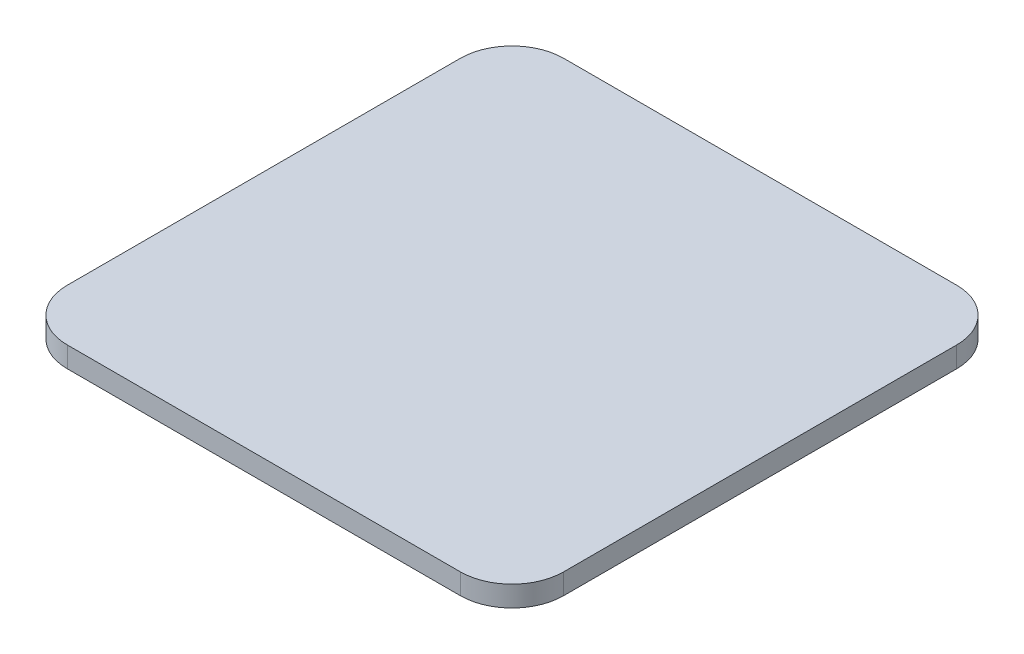
ISO-10303-21;
HEADER;
FILE_DESCRIPTION(('STEP AP214'),'2;1');
FILE_NAME('part.step','',(''),(''),'','','');
FILE_SCHEMA(('AUTOMOTIVE_DESIGN { 1 0 10303 214 1 1 1 1 }'));
ENDSEC;
DATA;
#1=APPLICATION_CONTEXT('core data for automotive mechanical design processes');
#2=APPLICATION_PROTOCOL_DEFINITION('international standard','automotive_design',2000,#1);
#3=PRODUCT_CONTEXT('',#1,'mechanical');
#4=PRODUCT('Part','Part','',(#3));
#5=PRODUCT_RELATED_PRODUCT_CATEGORY('part','',(#4));
#6=PRODUCT_DEFINITION_FORMATION('','',#4);
#7=PRODUCT_DEFINITION_CONTEXT('part definition',#1,'design');
#8=PRODUCT_DEFINITION('design','',#6,#7);
#9=PRODUCT_DEFINITION_SHAPE('','',#8);
#10=(LENGTH_UNIT() NAMED_UNIT(*) SI_UNIT(.MILLI.,.METRE.));
#11=(NAMED_UNIT(*) PLANE_ANGLE_UNIT() SI_UNIT($,.RADIAN.));
#12=(NAMED_UNIT(*) SI_UNIT($,.STERADIAN.) SOLID_ANGLE_UNIT());
#13=UNCERTAINTY_MEASURE_WITH_UNIT(LENGTH_MEASURE(1.E-05),#10,'distance_accuracy_value','');
#14=(GEOMETRIC_REPRESENTATION_CONTEXT(3) GLOBAL_UNCERTAINTY_ASSIGNED_CONTEXT((#13)) GLOBAL_UNIT_ASSIGNED_CONTEXT((#10,
#11,#12)) REPRESENTATION_CONTEXT('',''));
#15=CARTESIAN_POINT('',(0.,0.,0.));
#16=DIRECTION('',(0.,0.,1.));
#17=DIRECTION('',(1.,0.,0.));
#18=AXIS2_PLACEMENT_3D('',#15,#16,#17);
#19=CARTESIAN_POINT('',(19.,2.,19.));
#20=DIRECTION('',(0.,-1.,0.));
#21=DIRECTION('',(0.,0.,-1.));
#22=AXIS2_PLACEMENT_3D('',#19,#20,#21);
#23=CYLINDRICAL_SURFACE('',#22,5.);
#24=CARTESIAN_POINT('',(19.,0.,19.));
#25=DIRECTION('',(0.,1.,0.));
#26=DIRECTION('',(0.,0.,1.));
#27=AXIS2_PLACEMENT_3D('',#24,#25,#26);
#28=CIRCLE('',#27,5.);
#29=CARTESIAN_POINT('',(19.,0.,24.));
#30=VERTEX_POINT('',#29);
#31=CARTESIAN_POINT('',(24.,0.,19.));
#32=VERTEX_POINT('',#31);
#33=EDGE_CURVE('E140',#30,#32,#28,.T.);
#34=ORIENTED_EDGE('',*,*,#33,.T.);
#35=DIRECTION('',(0.,-1.,0.));
#36=VECTOR('',#35,1.);
#37=CARTESIAN_POINT('',(24.,2.,19.));
#38=LINE('',#37,#36);
#39=CARTESIAN_POINT('',(24.,2.,19.));
#40=VERTEX_POINT('',#39);
#41=EDGE_CURVE('E11',#40,#32,#38,.T.);
#42=ORIENTED_EDGE('',*,*,#41,.F.);
#43=CARTESIAN_POINT('',(19.,2.,19.));
#44=DIRECTION('',(0.,1.,0.));
#45=DIRECTION('',(0.,0.,1.));
#46=AXIS2_PLACEMENT_3D('',#43,#44,#45);
#47=CIRCLE('',#46,5.);
#48=CARTESIAN_POINT('',(19.,2.,24.));
#49=VERTEX_POINT('',#48);
#50=EDGE_CURVE('E162',#49,#40,#47,.T.);
#51=ORIENTED_EDGE('',*,*,#50,.F.);
#52=DIRECTION('',(0.,-1.,0.));
#53=VECTOR('',#52,1.);
#54=CARTESIAN_POINT('',(19.,2.,24.));
#55=LINE('',#54,#53);
#56=EDGE_CURVE('E136',#49,#30,#55,.T.);
#57=ORIENTED_EDGE('',*,*,#56,.T.);
#58=EDGE_LOOP('',(#34,#42,#51,#57));
#59=FACE_BOUND('',#58,.T.);
#60=ADVANCED_FACE('F39',(#59),#23,.T.);
#61=CARTESIAN_POINT('',(24.,2.,-19.));
#62=DIRECTION('',(-1.,0.,0.));
#63=DIRECTION('',(0.,0.,1.));
#64=AXIS2_PLACEMENT_3D('',#61,#62,#63);
#65=PLANE('',#64);
#66=DIRECTION('',(0.,0.,-1.));
#67=VECTOR('',#66,1.);
#68=CARTESIAN_POINT('',(24.,0.,-19.));
#69=LINE('',#68,#67);
#70=CARTESIAN_POINT('',(24.,0.,-19.));
#71=VERTEX_POINT('',#70);
#72=EDGE_CURVE('E144',#32,#71,#69,.T.);
#73=ORIENTED_EDGE('',*,*,#72,.T.);
#74=DIRECTION('',(0.,-1.,0.));
#75=VECTOR('',#74,1.);
#76=CARTESIAN_POINT('',(24.,2.,-19.));
#77=LINE('',#76,#75);
#78=CARTESIAN_POINT('',(24.,2.,-19.));
#79=VERTEX_POINT('',#78);
#80=EDGE_CURVE('E48',#79,#71,#77,.T.);
#81=ORIENTED_EDGE('',*,*,#80,.F.);
#82=DIRECTION('',(0.,0.,-1.));
#83=VECTOR('',#82,1.);
#84=CARTESIAN_POINT('',(24.,2.,-19.));
#85=LINE('',#84,#83);
#86=EDGE_CURVE('E99',#40,#79,#85,.T.);
#87=ORIENTED_EDGE('',*,*,#86,.F.);
#88=ORIENTED_EDGE('',*,*,#41,.T.);
#89=EDGE_LOOP('',(#73,#81,#87,#88));
#90=FACE_BOUND('',#89,.T.);
#91=ADVANCED_FACE('F208',(#90),#65,.F.);
#92=CARTESIAN_POINT('',(19.,2.,-19.));
#93=DIRECTION('',(0.,-1.,0.));
#94=DIRECTION('',(0.,0.,-1.));
#95=AXIS2_PLACEMENT_3D('',#92,#93,#94);
#96=CYLINDRICAL_SURFACE('',#95,5.);
#97=CARTESIAN_POINT('',(19.,0.,-19.));
#98=DIRECTION('',(0.,1.,0.));
#99=DIRECTION('',(0.,0.,1.));
#100=AXIS2_PLACEMENT_3D('',#97,#98,#99);
#101=CIRCLE('',#100,5.);
#102=CARTESIAN_POINT('',(19.,0.,-24.));
#103=VERTEX_POINT('',#102);
#104=EDGE_CURVE('E147',#71,#103,#101,.T.);
#105=ORIENTED_EDGE('',*,*,#104,.T.);
#106=DIRECTION('',(0.,-1.,0.));
#107=VECTOR('',#106,1.);
#108=CARTESIAN_POINT('',(19.,2.,-24.));
#109=LINE('',#108,#107);
#110=CARTESIAN_POINT('',(19.,2.,-24.));
#111=VERTEX_POINT('',#110);
#112=EDGE_CURVE('E173',#111,#103,#109,.T.);
#113=ORIENTED_EDGE('',*,*,#112,.F.);
#114=CARTESIAN_POINT('',(19.,2.,-19.));
#115=DIRECTION('',(0.,1.,0.));
#116=DIRECTION('',(0.,0.,1.));
#117=AXIS2_PLACEMENT_3D('',#114,#115,#116);
#118=CIRCLE('',#117,5.);
#119=EDGE_CURVE('E183',#79,#111,#118,.T.);
#120=ORIENTED_EDGE('',*,*,#119,.F.);
#121=ORIENTED_EDGE('',*,*,#80,.T.);
#122=EDGE_LOOP('',(#105,#113,#120,#121));
#123=FACE_BOUND('',#122,.T.);
#124=ADVANCED_FACE('F181',(#123),#96,.T.);
#125=CARTESIAN_POINT('',(-19.,2.,-24.));
#126=DIRECTION('',(0.,0.,1.));
#127=DIRECTION('',(1.,0.,0.));
#128=AXIS2_PLACEMENT_3D('',#125,#126,#127);
#129=PLANE('',#128);
#130=DIRECTION('',(-1.,0.,0.));
#131=VECTOR('',#130,1.);
#132=CARTESIAN_POINT('',(-19.,0.,-24.));
#133=LINE('',#132,#131);
#134=CARTESIAN_POINT('',(-19.,0.,-24.));
#135=VERTEX_POINT('',#134);
#136=EDGE_CURVE('E150',#103,#135,#133,.T.);
#137=ORIENTED_EDGE('',*,*,#136,.T.);
#138=DIRECTION('',(0.,-1.,0.));
#139=VECTOR('',#138,1.);
#140=CARTESIAN_POINT('',(-19.,2.,-24.));
#141=LINE('',#140,#139);
#142=CARTESIAN_POINT('',(-19.,2.,-24.));
#143=VERTEX_POINT('',#142);
#144=EDGE_CURVE('E169',#143,#135,#141,.T.);
#145=ORIENTED_EDGE('',*,*,#144,.F.);
#146=DIRECTION('',(-1.,0.,0.));
#147=VECTOR('',#146,1.);
#148=CARTESIAN_POINT('',(-19.,2.,-24.));
#149=LINE('',#148,#147);
#150=EDGE_CURVE('E196',#111,#143,#149,.T.);
#151=ORIENTED_EDGE('',*,*,#150,.F.);
#152=ORIENTED_EDGE('',*,*,#112,.T.);
#153=EDGE_LOOP('',(#137,#145,#151,#152));
#154=FACE_BOUND('',#153,.T.);
#155=ADVANCED_FACE('F191',(#154),#129,.F.);
#156=CARTESIAN_POINT('',(-19.,2.,-19.));
#157=DIRECTION('',(0.,-1.,0.));
#158=DIRECTION('',(0.,0.,-1.));
#159=AXIS2_PLACEMENT_3D('',#156,#157,#158);
#160=CYLINDRICAL_SURFACE('',#159,5.);
#161=CARTESIAN_POINT('',(-19.,0.,-19.));
#162=DIRECTION('',(0.,1.,0.));
#163=DIRECTION('',(0.,0.,1.));
#164=AXIS2_PLACEMENT_3D('',#161,#162,#163);
#165=CIRCLE('',#164,5.);
#166=CARTESIAN_POINT('',(-24.,0.,-19.));
#167=VERTEX_POINT('',#166);
#168=EDGE_CURVE('E153',#135,#167,#165,.T.);
#169=ORIENTED_EDGE('',*,*,#168,.T.);
#170=DIRECTION('',(0.,-1.,0.));
#171=VECTOR('',#170,1.);
#172=CARTESIAN_POINT('',(-24.,2.,-19.));
#173=LINE('',#172,#171);
#174=CARTESIAN_POINT('',(-24.,2.,-19.));
#175=VERTEX_POINT('',#174);
#176=EDGE_CURVE('E129',#175,#167,#173,.T.);
#177=ORIENTED_EDGE('',*,*,#176,.F.);
#178=CARTESIAN_POINT('',(-19.,2.,-19.));
#179=DIRECTION('',(0.,1.,0.));
#180=DIRECTION('',(0.,0.,1.));
#181=AXIS2_PLACEMENT_3D('',#178,#179,#180);
#182=CIRCLE('',#181,5.);
#183=EDGE_CURVE('E118',#143,#175,#182,.T.);
#184=ORIENTED_EDGE('',*,*,#183,.F.);
#185=ORIENTED_EDGE('',*,*,#144,.T.);
#186=EDGE_LOOP('',(#169,#177,#184,#185));
#187=FACE_BOUND('',#186,.T.);
#188=ADVANCED_FACE('F194',(#187),#160,.T.);
#189=CARTESIAN_POINT('',(-24.,2.,-19.));
#190=DIRECTION('',(1.,0.,0.));
#191=DIRECTION('',(0.,0.,-1.));
#192=AXIS2_PLACEMENT_3D('',#189,#190,#191);
#193=PLANE('',#192);
#194=DIRECTION('',(0.,0.,1.));
#195=VECTOR('',#194,1.);
#196=CARTESIAN_POINT('',(-24.,0.,-19.));
#197=LINE('',#196,#195);
#198=CARTESIAN_POINT('',(-24.,0.,19.));
#199=VERTEX_POINT('',#198);
#200=EDGE_CURVE('E127',#167,#199,#197,.T.);
#201=ORIENTED_EDGE('',*,*,#200,.T.);
#202=DIRECTION('',(0.,-1.,0.));
#203=VECTOR('',#202,1.);
#204=CARTESIAN_POINT('',(-24.,2.,19.));
#205=LINE('',#204,#203);
#206=CARTESIAN_POINT('',(-24.,2.,19.));
#207=VERTEX_POINT('',#206);
#208=EDGE_CURVE('E124',#207,#199,#205,.T.);
#209=ORIENTED_EDGE('',*,*,#208,.F.);
#210=DIRECTION('',(0.,0.,1.));
#211=VECTOR('',#210,1.);
#212=CARTESIAN_POINT('',(-24.,2.,-19.));
#213=LINE('',#212,#211);
#214=EDGE_CURVE('E112',#175,#207,#213,.T.);
#215=ORIENTED_EDGE('',*,*,#214,.F.);
#216=ORIENTED_EDGE('',*,*,#176,.T.);
#217=EDGE_LOOP('',(#201,#209,#215,#216));
#218=FACE_BOUND('',#217,.T.);
#219=ADVANCED_FACE('F125',(#218),#193,.F.);
#220=CARTESIAN_POINT('',(-19.,2.,19.));
#221=DIRECTION('',(0.,-1.,0.));
#222=DIRECTION('',(0.,0.,-1.));
#223=AXIS2_PLACEMENT_3D('',#220,#221,#222);
#224=CYLINDRICAL_SURFACE('',#223,5.);
#225=CARTESIAN_POINT('',(-19.,0.,19.));
#226=DIRECTION('',(0.,1.,0.));
#227=DIRECTION('',(0.,0.,-1.));
#228=AXIS2_PLACEMENT_3D('',#225,#226,#227);
#229=CIRCLE('',#228,5.);
#230=CARTESIAN_POINT('',(-19.,0.,24.));
#231=VERTEX_POINT('',#230);
#232=EDGE_CURVE('E85',#199,#231,#229,.T.);
#233=ORIENTED_EDGE('',*,*,#232,.T.);
#234=DIRECTION('',(0.,-1.,0.));
#235=VECTOR('',#234,1.);
#236=CARTESIAN_POINT('',(-19.,2.,24.));
#237=LINE('',#236,#235);
#238=CARTESIAN_POINT('',(-19.,2.,24.));
#239=VERTEX_POINT('',#238);
#240=EDGE_CURVE('E130',#239,#231,#237,.T.);
#241=ORIENTED_EDGE('',*,*,#240,.F.);
#242=CARTESIAN_POINT('',(-19.,2.,19.));
#243=DIRECTION('',(0.,1.,0.));
#244=DIRECTION('',(0.,0.,-1.));
#245=AXIS2_PLACEMENT_3D('',#242,#243,#244);
#246=CIRCLE('',#245,5.);
#247=EDGE_CURVE('E116',#207,#239,#246,.T.);
#248=ORIENTED_EDGE('',*,*,#247,.F.);
#249=ORIENTED_EDGE('',*,*,#208,.T.);
#250=EDGE_LOOP('',(#233,#241,#248,#249));
#251=FACE_BOUND('',#250,.T.);
#252=ADVANCED_FACE('F132',(#251),#224,.T.);
#253=CARTESIAN_POINT('',(-19.,2.,24.));
#254=DIRECTION('',(0.,0.,-1.));
#255=DIRECTION('',(-1.,0.,0.));
#256=AXIS2_PLACEMENT_3D('',#253,#254,#255);
#257=PLANE('',#256);
#258=DIRECTION('',(1.,0.,0.));
#259=VECTOR('',#258,1.);
#260=CARTESIAN_POINT('',(-19.,0.,24.));
#261=LINE('',#260,#259);
#262=EDGE_CURVE('E91',#231,#30,#261,.T.);
#263=ORIENTED_EDGE('',*,*,#262,.T.);
#264=ORIENTED_EDGE('',*,*,#56,.F.);
#265=DIRECTION('',(1.,0.,0.));
#266=VECTOR('',#265,1.);
#267=CARTESIAN_POINT('',(-19.,2.,24.));
#268=LINE('',#267,#266);
#269=EDGE_CURVE('E56',#239,#49,#268,.T.);
#270=ORIENTED_EDGE('',*,*,#269,.F.);
#271=ORIENTED_EDGE('',*,*,#240,.T.);
#272=EDGE_LOOP('',(#263,#264,#270,#271));
#273=FACE_BOUND('',#272,.T.);
#274=ADVANCED_FACE('F224',(#273),#257,.F.);
#275=CARTESIAN_POINT('',(19.,2.,19.));
#276=DIRECTION('',(0.,1.,0.));
#277=DIRECTION('',(0.,0.,1.));
#278=AXIS2_PLACEMENT_3D('',#275,#276,#277);
#279=PLANE('',#278);
#280=ORIENTED_EDGE('',*,*,#50,.T.);
#281=ORIENTED_EDGE('',*,*,#86,.T.);
#282=ORIENTED_EDGE('',*,*,#119,.T.);
#283=ORIENTED_EDGE('',*,*,#150,.T.);
#284=ORIENTED_EDGE('',*,*,#183,.T.);
#285=ORIENTED_EDGE('',*,*,#214,.T.);
#286=ORIENTED_EDGE('',*,*,#247,.T.);
#287=ORIENTED_EDGE('',*,*,#269,.T.);
#288=EDGE_LOOP('',(#280,#281,#282,#283,#284,#285,#286,#287));
#289=FACE_BOUND('',#288,.T.);
#290=ADVANCED_FACE('F114',(#289),#279,.T.);
#291=CARTESIAN_POINT('',(19.,0.,19.));
#292=DIRECTION('',(0.,1.,0.));
#293=DIRECTION('',(0.,0.,1.));
#294=AXIS2_PLACEMENT_3D('',#291,#292,#293);
#295=PLANE('',#294);
#296=ORIENTED_EDGE('',*,*,#33,.F.);
#297=ORIENTED_EDGE('',*,*,#262,.F.);
#298=ORIENTED_EDGE('',*,*,#232,.F.);
#299=ORIENTED_EDGE('',*,*,#200,.F.);
#300=ORIENTED_EDGE('',*,*,#168,.F.);
#301=ORIENTED_EDGE('',*,*,#136,.F.);
#302=ORIENTED_EDGE('',*,*,#104,.F.);
#303=ORIENTED_EDGE('',*,*,#72,.F.);
#304=EDGE_LOOP('',(#296,#297,#298,#299,#300,#301,#302,#303));
#305=FACE_BOUND('',#304,.T.);
#306=ADVANCED_FACE('F187',(#305),#295,.F.);
#307=CLOSED_SHELL('',(#60,#91,#124,#155,#188,#219,#252,#274,#290,#306));
#308=MANIFOLD_SOLID_BREP('B2',#307);
#309=ADVANCED_BREP_SHAPE_REPRESENTATION('',(#18,#308),#14);
#310=SHAPE_DEFINITION_REPRESENTATION(#9,#309);
ENDSEC;
END-ISO-10303-21;
